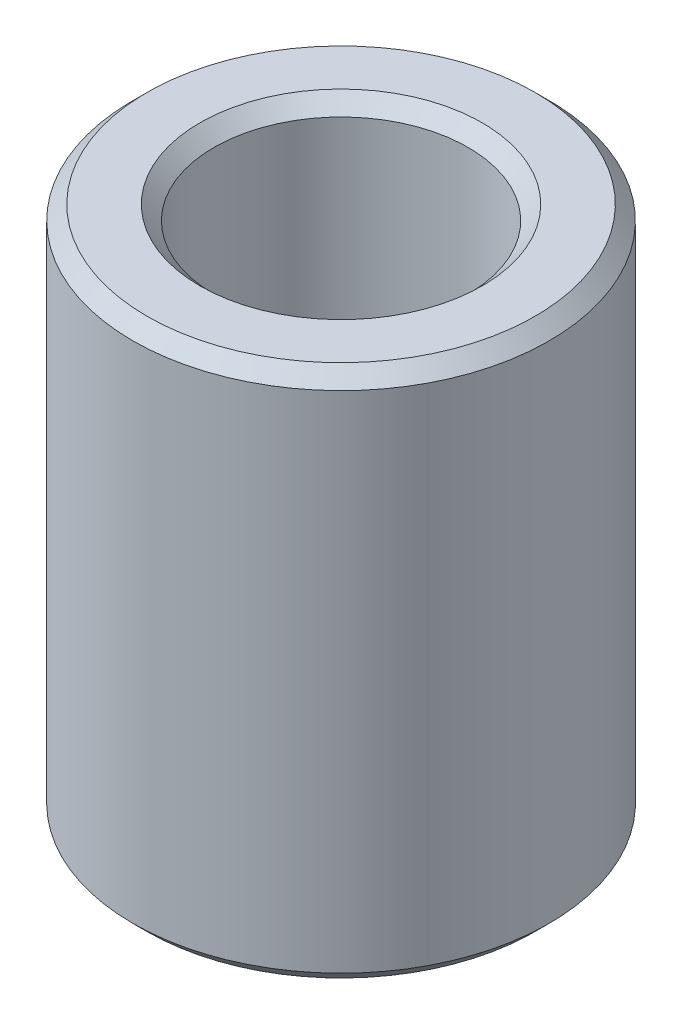
ISO-10303-21;
HEADER;
FILE_DESCRIPTION(('STEP AP214'),'2;1');
FILE_NAME('part.step','',(''),(''),'','','');
FILE_SCHEMA(('AUTOMOTIVE_DESIGN { 1 0 10303 214 1 1 1 1 }'));
ENDSEC;
DATA;
#1=APPLICATION_CONTEXT('core data for automotive mechanical design processes');
#2=APPLICATION_PROTOCOL_DEFINITION('international standard','automotive_design',2000,#1);
#3=PRODUCT_CONTEXT('',#1,'mechanical');
#4=PRODUCT('Part','Part','',(#3));
#5=PRODUCT_RELATED_PRODUCT_CATEGORY('part','',(#4));
#6=PRODUCT_DEFINITION_FORMATION('','',#4);
#7=PRODUCT_DEFINITION_CONTEXT('part definition',#1,'design');
#8=PRODUCT_DEFINITION('design','',#6,#7);
#9=PRODUCT_DEFINITION_SHAPE('','',#8);
#10=(LENGTH_UNIT() NAMED_UNIT(*) SI_UNIT(.MILLI.,.METRE.));
#11=(NAMED_UNIT(*) PLANE_ANGLE_UNIT() SI_UNIT($,.RADIAN.));
#12=(NAMED_UNIT(*) SI_UNIT($,.STERADIAN.) SOLID_ANGLE_UNIT());
#13=UNCERTAINTY_MEASURE_WITH_UNIT(LENGTH_MEASURE(1.E-05),#10,'distance_accuracy_value','');
#14=(GEOMETRIC_REPRESENTATION_CONTEXT(3) GLOBAL_UNCERTAINTY_ASSIGNED_CONTEXT((#13)) GLOBAL_UNIT_ASSIGNED_CONTEXT((#10,
#11,#12)) REPRESENTATION_CONTEXT('',''));
#15=CARTESIAN_POINT('',(0.,0.,0.));
#16=DIRECTION('',(0.,0.,1.));
#17=DIRECTION('',(1.,0.,0.));
#18=AXIS2_PLACEMENT_3D('',#15,#16,#17);
#19=CARTESIAN_POINT('',(0.,128.015763777899,0.));
#20=DIRECTION('',(0.,-1.,0.));
#21=DIRECTION('',(0.,0.,-1.));
#22=AXIS2_PLACEMENT_3D('',#19,#20,#21);
#23=CYLINDRICAL_SURFACE('',#22,50.);
#24=CARTESIAN_POINT('',(0.,3.40679322849684,0.));
#25=DIRECTION('',(0.,1.,0.));
#26=DIRECTION('',(0.,0.,1.));
#27=AXIS2_PLACEMENT_3D('',#24,#25,#26);
#28=CIRCLE('',#27,50.);
#29=CARTESIAN_POINT('',(0.,3.40679322849684,50.));
#30=VERTEX_POINT('',#29);
#31=EDGE_CURVE('E10',#30,#30,#28,.T.);
#32=ORIENTED_EDGE('',*,*,#31,.T.);
#33=EDGE_LOOP('',(#32));
#34=FACE_BOUND('',#33,.T.);
#35=CARTESIAN_POINT('',(0.,124.608970549402,0.));
#36=DIRECTION('',(0.,1.,0.));
#37=DIRECTION('',(0.,0.,1.));
#38=AXIS2_PLACEMENT_3D('',#35,#36,#37);
#39=CIRCLE('',#38,50.);
#40=CARTESIAN_POINT('',(0.,124.608970549402,50.));
#41=VERTEX_POINT('',#40);
#42=EDGE_CURVE('E50',#41,#41,#39,.F.);
#43=ORIENTED_EDGE('',*,*,#42,.T.);
#44=EDGE_LOOP('',(#43));
#45=FACE_BOUND('',#44,.T.);
#46=ADVANCED_FACE('F39',(#34,#45),#23,.T.);
#47=CARTESIAN_POINT('',(0.,128.015763777899,0.));
#48=DIRECTION('',(0.,1.,0.));
#49=DIRECTION('',(0.,0.,1.));
#50=AXIS2_PLACEMENT_3D('',#47,#48,#49);
#51=PLANE('',#50);
#52=CARTESIAN_POINT('',(0.,128.015763777899,0.));
#53=DIRECTION('',(0.,1.,0.));
#54=DIRECTION('',(0.,0.,1.));
#55=AXIS2_PLACEMENT_3D('',#52,#53,#54);
#56=CIRCLE('',#55,33.9259071742201);
#57=CARTESIAN_POINT('',(0.,128.015763777899,33.9259071742201));
#58=VERTEX_POINT('',#57);
#59=EDGE_CURVE('E58',#58,#58,#56,.F.);
#60=ORIENTED_EDGE('',*,*,#59,.T.);
#61=EDGE_LOOP('',(#60));
#62=FACE_BOUND('',#61,.T.);
#63=CARTESIAN_POINT('',(0.,128.015763777899,0.));
#64=DIRECTION('',(0.,1.,0.));
#65=DIRECTION('',(0.,0.,1.));
#66=AXIS2_PLACEMENT_3D('',#63,#64,#65);
#67=CIRCLE('',#66,46.5932067715032);
#68=CARTESIAN_POINT('',(0.,128.015763777899,46.5932067715032));
#69=VERTEX_POINT('',#68);
#70=EDGE_CURVE('E61',#69,#69,#67,.T.);
#71=ORIENTED_EDGE('',*,*,#70,.T.);
#72=EDGE_LOOP('',(#71));
#73=FACE_BOUND('',#72,.T.);
#74=ADVANCED_FACE('F88',(#62,#73),#51,.T.);
#75=CARTESIAN_POINT('',(0.,0.,0.));
#76=DIRECTION('',(0.,1.,0.));
#77=DIRECTION('',(0.,0.,1.));
#78=AXIS2_PLACEMENT_3D('',#75,#76,#77);
#79=PLANE('',#78);
#80=CARTESIAN_POINT('',(0.,0.,0.));
#81=DIRECTION('',(0.,1.,0.));
#82=DIRECTION('',(0.,0.,1.));
#83=AXIS2_PLACEMENT_3D('',#80,#81,#82);
#84=CIRCLE('',#83,33.9259071742202);
#85=CARTESIAN_POINT('',(0.,0.,33.9259071742202));
#86=VERTEX_POINT('',#85);
#87=EDGE_CURVE('E51',#86,#86,#84,.T.);
#88=ORIENTED_EDGE('',*,*,#87,.T.);
#89=EDGE_LOOP('',(#88));
#90=FACE_BOUND('',#89,.T.);
#91=CARTESIAN_POINT('',(0.,0.,0.));
#92=DIRECTION('',(0.,1.,0.));
#93=DIRECTION('',(0.,0.,1.));
#94=AXIS2_PLACEMENT_3D('',#91,#92,#93);
#95=CIRCLE('',#94,46.5932067715032);
#96=CARTESIAN_POINT('',(0.,0.,46.5932067715032));
#97=VERTEX_POINT('',#96);
#98=EDGE_CURVE('E54',#97,#97,#95,.F.);
#99=ORIENTED_EDGE('',*,*,#98,.T.);
#100=EDGE_LOOP('',(#99));
#101=FACE_BOUND('',#100,.T.);
#102=ADVANCED_FACE('F83',(#90,#101),#79,.F.);
#103=CARTESIAN_POINT('',(0.,128.015763777899,0.));
#104=DIRECTION('',(0.,-1.,0.));
#105=DIRECTION('',(0.,0.,-1.));
#106=AXIS2_PLACEMENT_3D('',#103,#104,#105);
#107=CYLINDRICAL_SURFACE('',#106,30.5191139457234);
#108=CARTESIAN_POINT('',(0.,124.608970549402,0.));
#109=DIRECTION('',(0.,1.,0.));
#110=DIRECTION('',(0.,0.,1.));
#111=AXIS2_PLACEMENT_3D('',#108,#109,#110);
#112=CIRCLE('',#111,30.5191139457234);
#113=CARTESIAN_POINT('',(0.,124.608970549402,30.5191139457234));
#114=VERTEX_POINT('',#113);
#115=EDGE_CURVE('E67',#114,#114,#112,.T.);
#116=ORIENTED_EDGE('',*,*,#115,.T.);
#117=EDGE_LOOP('',(#116));
#118=FACE_BOUND('',#117,.T.);
#119=CARTESIAN_POINT('',(0.,3.40679322849687,0.));
#120=DIRECTION('',(0.,1.,0.));
#121=DIRECTION('',(0.,0.,1.));
#122=AXIS2_PLACEMENT_3D('',#119,#120,#121);
#123=CIRCLE('',#122,30.5191139457234);
#124=CARTESIAN_POINT('',(0.,3.40679322849687,30.5191139457234));
#125=VERTEX_POINT('',#124);
#126=EDGE_CURVE('E69',#125,#125,#123,.F.);
#127=ORIENTED_EDGE('',*,*,#126,.T.);
#128=EDGE_LOOP('',(#127));
#129=FACE_BOUND('',#128,.T.);
#130=ADVANCED_FACE('F71',(#118,#129),#107,.F.);
#131=CARTESIAN_POINT('',(0.,124.608970549402,0.));
#132=DIRECTION('',(0.,1.,0.));
#133=DIRECTION('',(0.,0.,1.));
#134=AXIS2_PLACEMENT_3D('',#131,#132,#133);
#135=CONICAL_SURFACE('',#134,30.5191139457234,0.785398163397449);
#136=ORIENTED_EDGE('',*,*,#59,.F.);
#137=EDGE_LOOP('',(#136));
#138=FACE_BOUND('',#137,.T.);
#139=ORIENTED_EDGE('',*,*,#115,.F.);
#140=EDGE_LOOP('',(#139));
#141=FACE_BOUND('',#140,.T.);
#142=ADVANCED_FACE('F77',(#138,#141),#135,.F.);
#143=CARTESIAN_POINT('',(0.,0.,0.));
#144=DIRECTION('',(0.,-1.,0.));
#145=DIRECTION('',(0.,0.,-1.));
#146=AXIS2_PLACEMENT_3D('',#143,#144,#145);
#147=CONICAL_SURFACE('',#146,33.9259071742202,0.785398163397443);
#148=ORIENTED_EDGE('',*,*,#126,.F.);
#149=EDGE_LOOP('',(#148));
#150=FACE_BOUND('',#149,.T.);
#151=ORIENTED_EDGE('',*,*,#87,.F.);
#152=EDGE_LOOP('',(#151));
#153=FACE_BOUND('',#152,.T.);
#154=ADVANCED_FACE('F73',(#150,#153),#147,.F.);
#155=CARTESIAN_POINT('',(0.,3.40679322849684,0.));
#156=DIRECTION('',(0.,1.,0.));
#157=DIRECTION('',(0.,0.,1.));
#158=AXIS2_PLACEMENT_3D('',#155,#156,#157);
#159=CONICAL_SURFACE('',#158,50.,0.785398163397449);
#160=ORIENTED_EDGE('',*,*,#98,.F.);
#161=EDGE_LOOP('',(#160));
#162=FACE_BOUND('',#161,.T.);
#163=ORIENTED_EDGE('',*,*,#31,.F.);
#164=EDGE_LOOP('',(#163));
#165=FACE_BOUND('',#164,.T.);
#166=ADVANCED_FACE('F76',(#162,#165),#159,.T.);
#167=CARTESIAN_POINT('',(0.,128.015763777899,0.));
#168=DIRECTION('',(0.,-1.,0.));
#169=DIRECTION('',(0.,0.,-1.));
#170=AXIS2_PLACEMENT_3D('',#167,#168,#169);
#171=CONICAL_SURFACE('',#170,46.5932067715032,0.785398163397438);
#172=ORIENTED_EDGE('',*,*,#42,.F.);
#173=EDGE_LOOP('',(#172));
#174=FACE_BOUND('',#173,.T.);
#175=ORIENTED_EDGE('',*,*,#70,.F.);
#176=EDGE_LOOP('',(#175));
#177=FACE_BOUND('',#176,.T.);
#178=ADVANCED_FACE('F45',(#174,#177),#171,.T.);
#179=CLOSED_SHELL('',(#46,#74,#102,#130,#142,#154,#166,#178));
#180=MANIFOLD_SOLID_BREP('B2',#179);
#181=ADVANCED_BREP_SHAPE_REPRESENTATION('',(#18,#180),#14);
#182=SHAPE_DEFINITION_REPRESENTATION(#9,#181);
ENDSEC;
END-ISO-10303-21;
